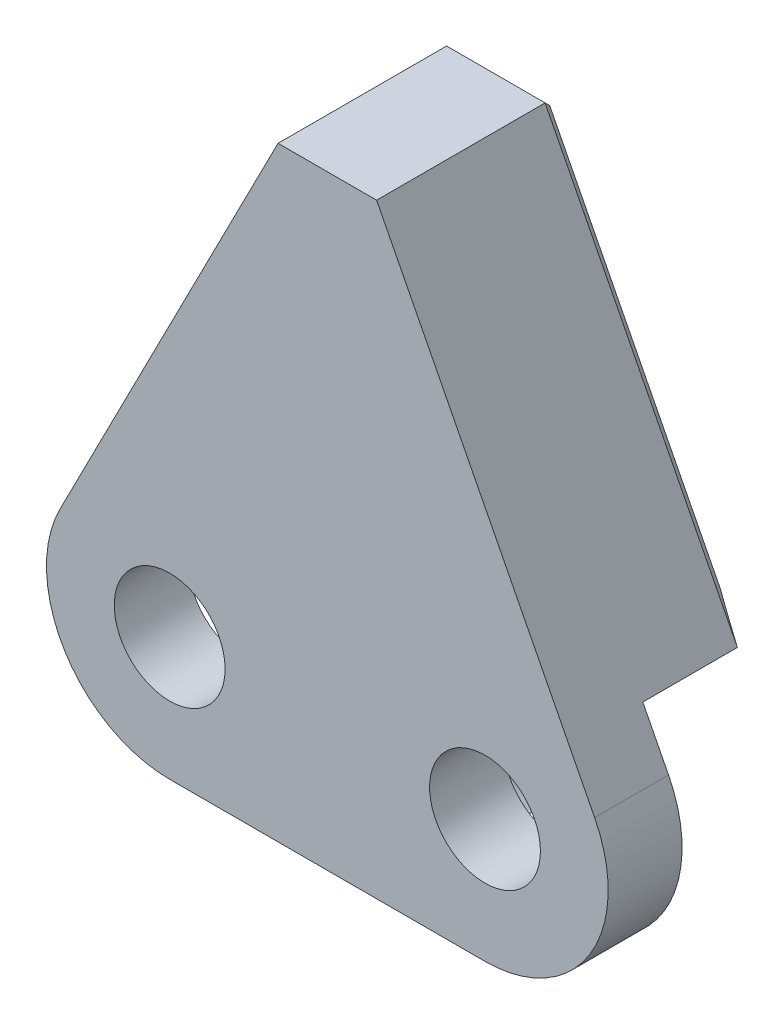
ISO-10303-21;
HEADER;
FILE_DESCRIPTION(('STEP AP214'),'2;1');
FILE_NAME('part.step','',(''),(''),'','','');
FILE_SCHEMA(('AUTOMOTIVE_DESIGN { 1 0 10303 214 1 1 1 1 }'));
ENDSEC;
DATA;
#1=APPLICATION_CONTEXT('core data for automotive mechanical design processes');
#2=APPLICATION_PROTOCOL_DEFINITION('international standard','automotive_design',2000,#1);
#3=PRODUCT_CONTEXT('',#1,'mechanical');
#4=PRODUCT('Part','Part','',(#3));
#5=PRODUCT_RELATED_PRODUCT_CATEGORY('part','',(#4));
#6=PRODUCT_DEFINITION_FORMATION('','',#4);
#7=PRODUCT_DEFINITION_CONTEXT('part definition',#1,'design');
#8=PRODUCT_DEFINITION('design','',#6,#7);
#9=PRODUCT_DEFINITION_SHAPE('','',#8);
#10=(LENGTH_UNIT() NAMED_UNIT(*) SI_UNIT(.MILLI.,.METRE.));
#11=(NAMED_UNIT(*) PLANE_ANGLE_UNIT() SI_UNIT($,.RADIAN.));
#12=(NAMED_UNIT(*) SI_UNIT($,.STERADIAN.) SOLID_ANGLE_UNIT());
#13=UNCERTAINTY_MEASURE_WITH_UNIT(LENGTH_MEASURE(1.E-05),#10,'distance_accuracy_value','');
#14=(GEOMETRIC_REPRESENTATION_CONTEXT(3) GLOBAL_UNCERTAINTY_ASSIGNED_CONTEXT((#13)) GLOBAL_UNIT_ASSIGNED_CONTEXT((#10,
#11,#12)) REPRESENTATION_CONTEXT('',''));
#15=CARTESIAN_POINT('',(0.,0.,0.));
#16=DIRECTION('',(0.,0.,1.));
#17=DIRECTION('',(1.,0.,0.));
#18=AXIS2_PLACEMENT_3D('',#15,#16,#17);
#19=CARTESIAN_POINT('',(0.,0.,1.11022302462516E-13));
#20=DIRECTION('',(0.,0.,1.00000000000004));
#21=DIRECTION('',(1.00000000000002,0.,0.));
#22=AXIS2_PLACEMENT_3D('',#19,#20,#21);
#23=PLANE('',#22);
#24=CARTESIAN_POINT('',(20.3199999999883,-1.30442627794494E-12,0.));
#25=DIRECTION('',(0.,0.,1.00000000000004));
#26=DIRECTION('',(1.00000000000002,0.,0.));
#27=AXIS2_PLACEMENT_3D('',#24,#25,#26);
#28=CIRCLE('',#27,3.57124);
#29=CARTESIAN_POINT('',(23.8912399999883,-1.3038164718836E-12,0.));
#30=VERTEX_POINT('',#29);
#31=EDGE_CURVE('E377',#30,#30,#28,.T.);
#32=ORIENTED_EDGE('',*,*,#31,.T.);
#33=EDGE_LOOP('',(#32));
#34=FACE_BOUND('',#33,.T.);
#35=CARTESIAN_POINT('',(20.3199999999883,-1.30442627794494E-12,0.));
#36=DIRECTION('',(0.,0.,1.00000000000004));
#37=DIRECTION('',(-1.00000000000002,0.,0.));
#38=AXIS2_PLACEMENT_3D('',#35,#36,#37);
#39=CIRCLE('',#38,8.73125);
#40=CARTESIAN_POINT('',(25.7266710426292,6.85584676018515,8.32667268468867E-13));
#41=VERTEX_POINT('',#40);
#42=CARTESIAN_POINT('',(14.734295665905,-6.71078487620774,-1.0547118733939E-12));
#43=VERTEX_POINT('',#42);
#44=EDGE_CURVE('E160',#41,#43,#39,.T.);
#45=ORIENTED_EDGE('',*,*,#44,.F.);
#46=DIRECTION('',(-0.455854631779661,0.890054242552123,0.));
#47=VECTOR('',#46,1.);
#48=CARTESIAN_POINT('',(13.3349999999879,31.0505321158113,-3.33066907387547E-13));
#49=LINE('',#48,#47);
#50=CARTESIAN_POINT('',(27.3848055502328,3.61834613975105,0.));
#51=VERTEX_POINT('',#50);
#52=EDGE_CURVE('E170',#51,#41,#49,.T.);
#53=ORIENTED_EDGE('',*,*,#52,.F.);
#54=CARTESIAN_POINT('',(20.3199999999746,0.,3.60822483003176E-13));
#55=DIRECTION('',(0.,0.,1.00000000000004));
#56=DIRECTION('',(-1.00000000000002,0.,0.));
#57=AXIS2_PLACEMENT_3D('',#54,#55,#56);
#58=CIRCLE('',#57,7.9375);
#59=CARTESIAN_POINT('',(20.3199999999744,-7.93749999999989,-7.7715611723761E-13));
#60=VERTEX_POINT('',#59);
#61=EDGE_CURVE('E182',#60,#51,#58,.T.);
#62=ORIENTED_EDGE('',*,*,#61,.F.);
#63=DIRECTION('',(1.00000000000002,0.,0.));
#64=VECTOR('',#63,1.);
#65=CARTESIAN_POINT('',(-2.08166817117217E-13,-7.93750000000005,-1.33226762955019E-12));
#66=LINE('',#65,#64);
#67=CARTESIAN_POINT('',(13.5075805421137,-7.93750000000003,-1.83186799063151E-12));
#68=VERTEX_POINT('',#67);
#69=EDGE_CURVE('E376',#68,#60,#66,.T.);
#70=ORIENTED_EDGE('',*,*,#69,.F.);
#71=DIRECTION('',(-0.707106781186563,-0.707106781186544,0.));
#72=VECTOR('',#71,1.);
#73=CARTESIAN_POINT('',(10.7225402710565,-10.7225402710567,-3.88578058618805E-13));
#74=LINE('',#73,#72);
#75=EDGE_CURVE('E173',#68,#43,#74,.F.);
#76=ORIENTED_EDGE('',*,*,#75,.T.);
#77=EDGE_LOOP('',(#45,#53,#62,#70,#76));
#78=FACE_BOUND('',#77,.T.);
#79=ADVANCED_FACE('F36',(#34,#78),#23,.F.);
#80=CARTESIAN_POINT('',(-1.23651089367627E-11,-1.26287869051112E-12,1.11022302462516E-13));
#81=DIRECTION('',(0.,0.,1.00000000000004));
#82=DIRECTION('',(1.00000000000002,0.,0.));
#83=AXIS2_PLACEMENT_3D('',#80,#81,#82);
#84=CIRCLE('',#83,3.57124);
#85=CARTESIAN_POINT('',(3.57123999998769,-1.26226888444977E-12,1.09287670579938E-13));
#86=VERTEX_POINT('',#85);
#87=EDGE_CURVE('E389',#86,#86,#84,.T.);
#88=ORIENTED_EDGE('',*,*,#87,.T.);
#89=EDGE_LOOP('',(#88));
#90=FACE_BOUND('',#89,.T.);
#91=CARTESIAN_POINT('',(0.,0.,0.));
#92=DIRECTION('',(0.,0.,1.00000000000004));
#93=DIRECTION('',(-1.00000000000002,0.,0.));
#94=AXIS2_PLACEMENT_3D('',#91,#92,#93);
#95=CIRCLE('',#94,8.73125);
#96=CARTESIAN_POINT('',(5.58570433407973,-6.7107848762083,-7.7715611723761E-13));
#97=VERTEX_POINT('',#96);
#98=CARTESIAN_POINT('',(-5.40667104266308,6.85584676017096,1.27675647831893E-12));
#99=VERTEX_POINT('',#98);
#100=EDGE_CURVE('E174',#97,#99,#95,.T.);
#101=ORIENTED_EDGE('',*,*,#100,.F.);
#102=DIRECTION('',(-0.707106781186563,0.707106781186543,0.));
#103=VECTOR('',#102,1.);
#104=CARTESIAN_POINT('',(-0.562540271064504,-0.562540271064428,-2.77555756156289E-13));
#105=LINE('',#104,#103);
#106=CARTESIAN_POINT('',(6.81241945787053,-7.93750000000002,-1.22124532708767E-12));
#107=VERTEX_POINT('',#106);
#108=EDGE_CURVE('E211',#97,#107,#105,.F.);
#109=ORIENTED_EDGE('',*,*,#108,.T.);
#110=CARTESIAN_POINT('',(-2.08166817117217E-13,-7.93750000000005,-1.33226762955019E-12));
#111=VERTEX_POINT('',#110);
#112=EDGE_CURVE('E186',#111,#107,#66,.T.);
#113=ORIENTED_EDGE('',*,*,#112,.F.);
#114=CARTESIAN_POINT('',(0.,0.,1.11022302462516E-13));
#115=DIRECTION('',(0.,0.,1.00000000000004));
#116=DIRECTION('',(1.00000000000002,0.,0.));
#117=AXIS2_PLACEMENT_3D('',#114,#115,#116);
#118=CIRCLE('',#117,7.9375);
#119=CARTESIAN_POINT('',(-7.06480555025765,3.61834613975104,-1.49880108324396E-12));
#120=VERTEX_POINT('',#119);
#121=EDGE_CURVE('E374',#120,#111,#118,.T.);
#122=ORIENTED_EDGE('',*,*,#121,.F.);
#123=DIRECTION('',(-0.455854631779664,-0.890054242552123,0.));
#124=VECTOR('',#123,1.);
#125=CARTESIAN_POINT('',(6.98499999998828,31.0505321158113,-6.66133814775094E-13));
#126=LINE('',#125,#124);
#127=EDGE_CURVE('E181',#99,#120,#126,.T.);
#128=ORIENTED_EDGE('',*,*,#127,.F.);
#129=EDGE_LOOP('',(#101,#109,#113,#122,#128));
#130=FACE_BOUND('',#129,.T.);
#131=ADVANCED_FACE('F308',(#90,#130),#23,.F.);
#132=CARTESIAN_POINT('',(0.,0.,4.76250000000017));
#133=DIRECTION('',(0.,0.,-1.00000000000003));
#134=DIRECTION('',(-1.00000000000002,0.,0.));
#135=AXIS2_PLACEMENT_3D('',#132,#133,#134);
#136=CYLINDRICAL_SURFACE('',#135,7.9375);
#137=ORIENTED_EDGE('',*,*,#121,.T.);
#138=DIRECTION('',(0.,0.,-1.00000000000003));
#139=VECTOR('',#138,1.);
#140=CARTESIAN_POINT('',(-4.16333634234434E-13,-7.93750000000003,4.76249999999884));
#141=LINE('',#140,#139);
#142=CARTESIAN_POINT('',(-4.16333634234434E-13,-7.93750000000003,4.76249999999884));
#143=VERTEX_POINT('',#142);
#144=EDGE_CURVE('E204',#143,#111,#141,.T.);
#145=ORIENTED_EDGE('',*,*,#144,.F.);
#146=CARTESIAN_POINT('',(0.,0.,4.76250000000017));
#147=DIRECTION('',(0.,0.,1.00000000000004));
#148=DIRECTION('',(1.00000000000002,0.,0.));
#149=AXIS2_PLACEMENT_3D('',#146,#147,#148);
#150=CIRCLE('',#149,7.9375);
#151=CARTESIAN_POINT('',(-7.0648055502581,3.618346139751,4.76249999999911));
#152=VERTEX_POINT('',#151);
#153=EDGE_CURVE('E184',#152,#143,#150,.T.);
#154=ORIENTED_EDGE('',*,*,#153,.F.);
#155=DIRECTION('',(0.,0.,-1.00000000000003));
#156=VECTOR('',#155,1.);
#157=CARTESIAN_POINT('',(-7.0648055502581,3.618346139751,4.76249999999911));
#158=LINE('',#157,#156);
#159=EDGE_CURVE('E190',#152,#120,#158,.T.);
#160=ORIENTED_EDGE('',*,*,#159,.T.);
#161=EDGE_LOOP('',(#137,#145,#154,#160));
#162=FACE_BOUND('',#161,.T.);
#163=ADVANCED_FACE('F314',(#162),#136,.T.);
#164=CARTESIAN_POINT('',(-4.16333634234434E-13,-7.93750000000003,4.76249999999884));
#165=DIRECTION('',(0.,1.,0.));
#166=DIRECTION('',(-1.00000000000002,0.,0.));
#167=AXIS2_PLACEMENT_3D('',#164,#165,#166);
#168=PLANE('',#167);
#169=DIRECTION('',(0.,0.,-1.00000000000004));
#170=VECTOR('',#169,1.);
#171=CARTESIAN_POINT('',(6.81241945787039,-7.93750000000001,4.76249999999984));
#172=LINE('',#171,#170);
#173=CARTESIAN_POINT('',(6.81241945787142,-7.93749999999999,-6.09600000000038));
#174=VERTEX_POINT('',#173);
#175=EDGE_CURVE('E209',#107,#174,#172,.T.);
#176=ORIENTED_EDGE('',*,*,#175,.T.);
#177=DIRECTION('',(1.00000000000002,0.,0.));
#178=VECTOR('',#177,1.);
#179=CARTESIAN_POINT('',(13.507580542113,-7.93749999999991,-6.09600000000077));
#180=LINE('',#179,#178);
#181=CARTESIAN_POINT('',(13.507580542113,-7.93749999999991,-6.09600000000077));
#182=VERTEX_POINT('',#181);
#183=EDGE_CURVE('E66',#174,#182,#180,.T.);
#184=ORIENTED_EDGE('',*,*,#183,.T.);
#185=DIRECTION('',(0.,0.,1.00000000000004));
#186=VECTOR('',#185,1.);
#187=CARTESIAN_POINT('',(13.5075805421135,-7.93749999999988,4.76249999999889));
#188=LINE('',#187,#186);
#189=EDGE_CURVE('E214',#182,#68,#188,.T.);
#190=ORIENTED_EDGE('',*,*,#189,.T.);
#191=ORIENTED_EDGE('',*,*,#69,.T.);
#192=DIRECTION('',(0.,0.,-1.00000000000003));
#193=VECTOR('',#192,1.);
#194=CARTESIAN_POINT('',(20.3199999999756,-7.93749999999991,4.7624999999995));
#195=LINE('',#194,#193);
#196=CARTESIAN_POINT('',(20.3199999999756,-7.93749999999991,4.7624999999995));
#197=VERTEX_POINT('',#196);
#198=EDGE_CURVE('E201',#197,#60,#195,.T.);
#199=ORIENTED_EDGE('',*,*,#198,.F.);
#200=DIRECTION('',(1.00000000000002,0.,0.));
#201=VECTOR('',#200,1.);
#202=CARTESIAN_POINT('',(-4.16333634234434E-13,-7.93750000000003,4.76249999999884));
#203=LINE('',#202,#201);
#204=EDGE_CURVE('E380',#143,#197,#203,.T.);
#205=ORIENTED_EDGE('',*,*,#204,.F.);
#206=ORIENTED_EDGE('',*,*,#144,.T.);
#207=ORIENTED_EDGE('',*,*,#112,.T.);
#208=EDGE_LOOP('',(#176,#184,#190,#191,#199,#205,#206,#207));
#209=FACE_BOUND('',#208,.T.);
#210=ADVANCED_FACE('F334',(#209),#168,.F.);
#211=CARTESIAN_POINT('',(20.3199999999755,0.,4.76249999999973));
#212=DIRECTION('',(0.,0.,-1.00000000000003));
#213=DIRECTION('',(-1.00000000000002,0.,0.));
#214=AXIS2_PLACEMENT_3D('',#211,#212,#213);
#215=CYLINDRICAL_SURFACE('',#214,7.9375);
#216=ORIENTED_EDGE('',*,*,#61,.T.);
#217=DIRECTION('',(0.,0.,-1.00000000000003));
#218=VECTOR('',#217,1.);
#219=CARTESIAN_POINT('',(27.384805550233,3.61834613975109,4.76249999999973));
#220=LINE('',#219,#218);
#221=CARTESIAN_POINT('',(27.384805550233,3.61834613975109,4.76249999999973));
#222=VERTEX_POINT('',#221);
#223=EDGE_CURVE('E180',#222,#51,#220,.T.);
#224=ORIENTED_EDGE('',*,*,#223,.F.);
#225=CARTESIAN_POINT('',(20.3199999999755,0.,4.76249999999973));
#226=DIRECTION('',(0.,0.,1.00000000000004));
#227=DIRECTION('',(-1.00000000000002,0.,0.));
#228=AXIS2_PLACEMENT_3D('',#225,#226,#227);
#229=CIRCLE('',#228,7.9375);
#230=EDGE_CURVE('E370',#197,#222,#229,.T.);
#231=ORIENTED_EDGE('',*,*,#230,.F.);
#232=ORIENTED_EDGE('',*,*,#198,.T.);
#233=EDGE_LOOP('',(#216,#224,#231,#232));
#234=FACE_BOUND('',#233,.T.);
#235=ADVANCED_FACE('F331',(#234),#215,.T.);
#236=CARTESIAN_POINT('',(13.3349999999876,31.0505321158113,4.76249999999873));
#237=DIRECTION('',(-0.89005424255214,-0.455854631779657,0.));
#238=DIRECTION('',(0.455854631779661,-0.890054242552123,0.));
#239=AXIS2_PLACEMENT_3D('',#236,#237,#238);
#240=PLANE('',#239);
#241=DIRECTION('',(0.,0.,1.00000000000004));
#242=VECTOR('',#241,1.);
#243=CARTESIAN_POINT('',(25.7266710426292,6.85584676018507,-51.570158260653));
#244=LINE('',#243,#242);
#245=CARTESIAN_POINT('',(25.7266710426295,6.85584676018515,-6.09599999999999));
#246=VERTEX_POINT('',#245);
#247=EDGE_CURVE('E157',#246,#41,#244,.T.);
#248=ORIENTED_EDGE('',*,*,#247,.F.);
#249=DIRECTION('',(-0.455854631779661,0.890054242552123,0.));
#250=VECTOR('',#249,1.);
#251=CARTESIAN_POINT('',(13.3349999999871,31.0505321158111,-6.09600000000088));
#252=LINE('',#251,#250);
#253=CARTESIAN_POINT('',(13.3349999999866,31.0505321158111,-6.09600000000132));
#254=VERTEX_POINT('',#253);
#255=EDGE_CURVE('E236',#246,#254,#252,.T.);
#256=ORIENTED_EDGE('',*,*,#255,.T.);
#257=DIRECTION('',(0.,0.,-1.00000000000003));
#258=VECTOR('',#257,1.);
#259=CARTESIAN_POINT('',(13.3349999999876,31.0505321158113,4.76249999999873));
#260=LINE('',#259,#258);
#261=CARTESIAN_POINT('',(13.3349999999876,31.0505321158113,4.76249999999873));
#262=VERTEX_POINT('',#261);
#263=EDGE_CURVE('E197',#262,#254,#260,.T.);
#264=ORIENTED_EDGE('',*,*,#263,.F.);
#265=DIRECTION('',(-0.455854631779661,0.890054242552123,0.));
#266=VECTOR('',#265,1.);
#267=CARTESIAN_POINT('',(13.3349999999876,31.0505321158113,4.76249999999873));
#268=LINE('',#267,#266);
#269=EDGE_CURVE('E367',#222,#262,#268,.T.);
#270=ORIENTED_EDGE('',*,*,#269,.F.);
#271=ORIENTED_EDGE('',*,*,#223,.T.);
#272=ORIENTED_EDGE('',*,*,#52,.T.);
#273=EDGE_LOOP('',(#248,#256,#264,#270,#271,#272));
#274=FACE_BOUND('',#273,.T.);
#275=ADVANCED_FACE('F177',(#274),#240,.F.);
#276=CARTESIAN_POINT('',(13.3349999999876,31.0505321158113,4.76249999999873));
#277=DIRECTION('',(0.,-1.,0.));
#278=DIRECTION('',(0.,0.,-1.00000000000004));
#279=AXIS2_PLACEMENT_3D('',#276,#277,#278);
#280=PLANE('',#279);
#281=ORIENTED_EDGE('',*,*,#263,.T.);
#282=DIRECTION('',(-1.00000000000002,0.,0.));
#283=VECTOR('',#282,1.);
#284=CARTESIAN_POINT('',(6.98499999998733,31.0505321158113,-6.09600000000154));
#285=LINE('',#284,#283);
#286=CARTESIAN_POINT('',(6.98499999998733,31.0505321158113,-6.09600000000154));
#287=VERTEX_POINT('',#286);
#288=EDGE_CURVE('E238',#254,#287,#285,.T.);
#289=ORIENTED_EDGE('',*,*,#288,.T.);
#290=DIRECTION('',(0.,0.,-1.00000000000003));
#291=VECTOR('',#290,1.);
#292=CARTESIAN_POINT('',(6.98499999998783,31.0505321158113,4.76249999999911));
#293=LINE('',#292,#291);
#294=CARTESIAN_POINT('',(6.98499999998783,31.0505321158113,4.76249999999911));
#295=VERTEX_POINT('',#294);
#296=EDGE_CURVE('E193',#295,#287,#293,.T.);
#297=ORIENTED_EDGE('',*,*,#296,.F.);
#298=DIRECTION('',(-1.00000000000002,0.,0.));
#299=VECTOR('',#298,1.);
#300=CARTESIAN_POINT('',(13.3349999999876,31.0505321158113,4.76249999999873));
#301=LINE('',#300,#299);
#302=EDGE_CURVE('E364',#262,#295,#301,.T.);
#303=ORIENTED_EDGE('',*,*,#302,.F.);
#304=EDGE_LOOP('',(#281,#289,#297,#303));
#305=FACE_BOUND('',#304,.T.);
#306=ADVANCED_FACE('F324',(#305),#280,.F.);
#307=CARTESIAN_POINT('',(6.98499999998783,31.0505321158113,4.76249999999911));
#308=DIRECTION('',(0.890054242552132,-0.455854631779656,0.));
#309=DIRECTION('',(0.455854631779664,0.890054242552124,0.));
#310=AXIS2_PLACEMENT_3D('',#307,#308,#309);
#311=PLANE('',#310);
#312=ORIENTED_EDGE('',*,*,#296,.T.);
#313=DIRECTION('',(-0.455854631779664,-0.890054242552124,0.));
#314=VECTOR('',#313,1.);
#315=CARTESIAN_POINT('',(-5.40667104266126,6.85584676017086,-6.09599999999832));
#316=LINE('',#315,#314);
#317=CARTESIAN_POINT('',(-5.40667104266126,6.85584676017086,-6.09599999999832));
#318=VERTEX_POINT('',#317);
#319=EDGE_CURVE('E240',#287,#318,#316,.T.);
#320=ORIENTED_EDGE('',*,*,#319,.T.);
#321=DIRECTION('',(0.,0.,1.00000000000004));
#322=VECTOR('',#321,1.);
#323=CARTESIAN_POINT('',(-5.40667104266296,6.85584676017083,-51.5701582606531));
#324=LINE('',#323,#322);
#325=EDGE_CURVE('E394',#318,#99,#324,.T.);
#326=ORIENTED_EDGE('',*,*,#325,.T.);
#327=ORIENTED_EDGE('',*,*,#127,.T.);
#328=ORIENTED_EDGE('',*,*,#159,.F.);
#329=DIRECTION('',(-0.455854631779664,-0.890054242552123,0.));
#330=VECTOR('',#329,1.);
#331=CARTESIAN_POINT('',(6.98499999998783,31.0505321158113,4.76249999999911));
#332=LINE('',#331,#330);
#333=EDGE_CURVE('E194',#295,#152,#332,.T.);
#334=ORIENTED_EDGE('',*,*,#333,.F.);
#335=EDGE_LOOP('',(#312,#320,#326,#327,#328,#334));
#336=FACE_BOUND('',#335,.T.);
#337=ADVANCED_FACE('F321',(#336),#311,.F.);
#338=CARTESIAN_POINT('',(0.,0.,4.76250000000017));
#339=DIRECTION('',(0.,0.,1.00000000000004));
#340=DIRECTION('',(1.00000000000002,0.,0.));
#341=AXIS2_PLACEMENT_3D('',#338,#339,#340);
#342=PLANE('',#341);
#343=CARTESIAN_POINT('',(-1.26010313294955E-11,-1.24183449082143E-12,4.76249999999873));
#344=DIRECTION('',(0.,0.,1.00000000000004));
#345=DIRECTION('',(1.00000000000002,0.,0.));
#346=AXIS2_PLACEMENT_3D('',#343,#344,#345);
#347=CIRCLE('',#346,3.57123999999999);
#348=CARTESIAN_POINT('',(3.57123999998745,-1.24122468476009E-12,4.76249999999872));
#349=VERTEX_POINT('',#348);
#350=EDGE_CURVE('E392',#349,#349,#347,.T.);
#351=ORIENTED_EDGE('',*,*,#350,.F.);
#352=EDGE_LOOP('',(#351));
#353=FACE_BOUND('',#352,.T.);
#354=CARTESIAN_POINT('',(20.3199999999878,-1.29725986606307E-12,4.76250000000034));
#355=DIRECTION('',(0.,0.,1.00000000000004));
#356=DIRECTION('',(1.00000000000002,0.,0.));
#357=AXIS2_PLACEMENT_3D('',#354,#355,#356);
#358=CIRCLE('',#357,3.57123999999999);
#359=CARTESIAN_POINT('',(23.8912399999878,-1.29665006000173E-12,4.76250000000033));
#360=VERTEX_POINT('',#359);
#361=EDGE_CURVE('E386',#360,#360,#358,.T.);
#362=ORIENTED_EDGE('',*,*,#361,.F.);
#363=EDGE_LOOP('',(#362));
#364=FACE_BOUND('',#363,.T.);
#365=ORIENTED_EDGE('',*,*,#153,.T.);
#366=ORIENTED_EDGE('',*,*,#204,.T.);
#367=ORIENTED_EDGE('',*,*,#230,.T.);
#368=ORIENTED_EDGE('',*,*,#269,.T.);
#369=ORIENTED_EDGE('',*,*,#302,.T.);
#370=ORIENTED_EDGE('',*,*,#333,.T.);
#371=EDGE_LOOP('',(#365,#366,#367,#368,#369,#370));
#372=FACE_BOUND('',#371,.T.);
#373=ADVANCED_FACE('F319',(#353,#364,#372),#342,.T.);
#374=CARTESIAN_POINT('',(20.3199999999878,-1.3180765477748E-12,4.76250000000006));
#375=DIRECTION('',(0.,0.,1.00000000000004));
#376=DIRECTION('',(1.00000000000002,0.,0.));
#377=AXIS2_PLACEMENT_3D('',#374,#375,#376);
#378=CYLINDRICAL_SURFACE('',#377,3.57123999999999);
#379=ORIENTED_EDGE('',*,*,#31,.F.);
#380=EDGE_LOOP('',(#379));
#381=FACE_BOUND('',#380,.T.);
#382=ORIENTED_EDGE('',*,*,#361,.T.);
#383=EDGE_LOOP('',(#382));
#384=FACE_BOUND('',#383,.T.);
#385=ADVANCED_FACE('F433',(#381,#384),#378,.F.);
#386=CARTESIAN_POINT('',(-1.26010313294955E-11,-1.24183449082143E-12,4.76249999999873));
#387=DIRECTION('',(0.,0.,1.00000000000004));
#388=DIRECTION('',(1.00000000000002,0.,0.));
#389=AXIS2_PLACEMENT_3D('',#386,#387,#388);
#390=CYLINDRICAL_SURFACE('',#389,3.57123999999999);
#391=ORIENTED_EDGE('',*,*,#87,.F.);
#392=EDGE_LOOP('',(#391));
#393=FACE_BOUND('',#392,.T.);
#394=ORIENTED_EDGE('',*,*,#350,.T.);
#395=EDGE_LOOP('',(#394));
#396=FACE_BOUND('',#395,.T.);
#397=ADVANCED_FACE('F426',(#393,#396),#390,.F.);
#398=CARTESIAN_POINT('',(0.,0.,-6.85800000000047));
#399=DIRECTION('',(0.,0.,-1.00000000000004));
#400=DIRECTION('',(-1.00000000000002,0.,0.));
#401=AXIS2_PLACEMENT_3D('',#398,#399,#400);
#402=PLANE('',#401);
#403=DIRECTION('',(1.00000000000002,0.,0.));
#404=VECTOR('',#403,1.);
#405=CARTESIAN_POINT('',(13.3349999999867,30.2885321158113,-6.85800000000003));
#406=LINE('',#405,#404);
#407=CARTESIAN_POINT('',(7.45085786657587,30.2885321158113,-6.85800000000136));
#408=VERTEX_POINT('',#407);
#409=CARTESIAN_POINT('',(12.8691421333977,30.2885321158114,-6.85800000000139));
#410=VERTEX_POINT('',#409);
#411=EDGE_CURVE('E231',#408,#410,#406,.T.);
#412=ORIENTED_EDGE('',*,*,#411,.T.);
#413=DIRECTION('',(0.455854631779662,-0.890054242552123,0.));
#414=VECTOR('',#413,1.);
#415=CARTESIAN_POINT('',(25.0484497098044,6.50848553076905,-6.85800000000186));
#416=LINE('',#415,#414);
#417=CARTESIAN_POINT('',(23.873162728778,8.80322839560663,-6.85800000000042));
#418=VERTEX_POINT('',#417);
#419=EDGE_CURVE('E233',#410,#418,#416,.T.);
#420=ORIENTED_EDGE('',*,*,#419,.T.);
#421=CARTESIAN_POINT('',(20.3199999999872,-1.30475390383321E-12,-6.85800000000072));
#422=DIRECTION('',(0.,0.,-1.00000000000004));
#423=DIRECTION('',(-1.00000000000002,0.,0.));
#424=AXIS2_PLACEMENT_3D('',#421,#422,#423);
#425=CIRCLE('',#424,9.49324999999999);
#426=CARTESIAN_POINT('',(13.6310253789904,-6.73642442859501,-6.85800000000064));
#427=VERTEX_POINT('',#426);
#428=EDGE_CURVE('E219',#418,#427,#425,.F.);
#429=ORIENTED_EDGE('',*,*,#428,.T.);
#430=DIRECTION('',(-0.707106781186563,-0.707106781186544,0.));
#431=VECTOR('',#430,1.);
#432=CARTESIAN_POINT('',(10.1837249037929,-10.1837249037926,-6.85800000000092));
#433=LINE('',#432,#431);
#434=CARTESIAN_POINT('',(13.1919498075851,-7.17550000000005,-6.85800000000203));
#435=VERTEX_POINT('',#434);
#436=EDGE_CURVE('E221',#427,#435,#433,.T.);
#437=ORIENTED_EDGE('',*,*,#436,.T.);
#438=DIRECTION('',(-1.00000000000002,0.,0.));
#439=VECTOR('',#438,1.);
#440=CARTESIAN_POINT('',(6.81241945787128,-7.17550000000004,-6.85800000000006));
#441=LINE('',#440,#439);
#442=CARTESIAN_POINT('',(7.12805019239821,-7.17550000000004,-6.85800000000139));
#443=VERTEX_POINT('',#442);
#444=EDGE_CURVE('E223',#435,#443,#441,.T.);
#445=ORIENTED_EDGE('',*,*,#444,.T.);
#446=DIRECTION('',(-0.707106781186563,0.707106781186543,0.));
#447=VECTOR('',#446,1.);
#448=CARTESIAN_POINT('',(-0.0237249038003984,-0.0237249038003085,-6.85800000000047));
#449=LINE('',#448,#447);
#450=CARTESIAN_POINT('',(6.68897462099408,-6.73642442859571,-6.85800000000145));
#451=VERTEX_POINT('',#450);
#452=EDGE_CURVE('E225',#443,#451,#449,.T.);
#453=ORIENTED_EDGE('',*,*,#452,.T.);
#454=CARTESIAN_POINT('',(0.,0.,-6.85800000000047));
#455=DIRECTION('',(0.,0.,-1.00000000000004));
#456=DIRECTION('',(-1.00000000000002,0.,0.));
#457=AXIS2_PLACEMENT_3D('',#454,#455,#456);
#458=CIRCLE('',#457,9.49324999999999);
#459=CARTESIAN_POINT('',(-3.55316272880546,8.80322839560201,-6.85799999999956));
#460=VERTEX_POINT('',#459);
#461=EDGE_CURVE('E227',#451,#460,#458,.F.);
#462=ORIENTED_EDGE('',*,*,#461,.T.);
#463=DIRECTION('',(0.455854631779664,0.890054242552124,0.));
#464=VECTOR('',#463,1.);
#465=CARTESIAN_POINT('',(7.66322133281228,30.7031708863953,-6.858));
#466=LINE('',#465,#464);
#467=EDGE_CURVE('E229',#460,#408,#466,.T.);
#468=ORIENTED_EDGE('',*,*,#467,.T.);
#469=EDGE_LOOP('',(#412,#420,#429,#437,#445,#453,#462,#468));
#470=FACE_BOUND('',#469,.T.);
#471=ADVANCED_FACE('F417',(#470),#402,.T.);
#472=CARTESIAN_POINT('',(20.3199999999881,-1.29995103509211E-12,-51.5701582606547));
#473=DIRECTION('',(0.,0.,1.00000000000004));
#474=DIRECTION('',(1.00000000000002,0.,0.));
#475=AXIS2_PLACEMENT_3D('',#472,#473,#474);
#476=CYLINDRICAL_SURFACE('',#475,8.73125);
#477=DIRECTION('',(0.,0.,1.00000000000004));
#478=VECTOR('',#477,1.);
#479=CARTESIAN_POINT('',(14.7342956659052,-6.71078487620774,-51.5701582606558));
#480=LINE('',#479,#478);
#481=CARTESIAN_POINT('',(14.7342956659064,-6.71078487620777,-6.0960000000016));
#482=VERTEX_POINT('',#481);
#483=EDGE_CURVE('E216',#43,#482,#480,.F.);
#484=ORIENTED_EDGE('',*,*,#483,.T.);
#485=CARTESIAN_POINT('',(20.3199999999876,-1.28390081924502E-12,-6.09599999999993));
#486=DIRECTION('',(0.,0.,-1.00000000000004));
#487=DIRECTION('',(-1.00000000000002,0.,0.));
#488=AXIS2_PLACEMENT_3D('',#485,#486,#487);
#489=CIRCLE('',#488,8.73125);
#490=EDGE_CURVE('E11',#482,#246,#489,.T.);
#491=ORIENTED_EDGE('',*,*,#490,.T.);
#492=ORIENTED_EDGE('',*,*,#247,.T.);
#493=ORIENTED_EDGE('',*,*,#44,.T.);
#494=EDGE_LOOP('',(#484,#491,#492,#493));
#495=FACE_BOUND('',#494,.T.);
#496=ADVANCED_FACE('F159',(#495),#476,.F.);
#497=CARTESIAN_POINT('',(-1.52655665885959E-13,0.,-51.5701582606548));
#498=DIRECTION('',(0.,0.,1.00000000000004));
#499=DIRECTION('',(1.00000000000002,0.,0.));
#500=AXIS2_PLACEMENT_3D('',#497,#498,#499);
#501=CYLINDRICAL_SURFACE('',#500,8.73125);
#502=ORIENTED_EDGE('',*,*,#325,.F.);
#503=CARTESIAN_POINT('',(-6.66133814775094E-13,0.,-6.09600000000032));
#504=DIRECTION('',(0.,0.,-1.00000000000004));
#505=DIRECTION('',(-1.00000000000002,0.,0.));
#506=AXIS2_PLACEMENT_3D('',#503,#504,#505);
#507=CIRCLE('',#506,8.73125);
#508=CARTESIAN_POINT('',(5.58570433407859,-6.71078487620832,-6.09600000000163));
#509=VERTEX_POINT('',#508);
#510=EDGE_CURVE('E242',#318,#509,#507,.T.);
#511=ORIENTED_EDGE('',*,*,#510,.T.);
#512=DIRECTION('',(0.,0.,1.00000000000004));
#513=VECTOR('',#512,1.);
#514=CARTESIAN_POINT('',(5.58570433407957,-6.71078487620834,-51.5701582606543));
#515=LINE('',#514,#513);
#516=EDGE_CURVE('E207',#509,#97,#515,.T.);
#517=ORIENTED_EDGE('',*,*,#516,.T.);
#518=ORIENTED_EDGE('',*,*,#100,.T.);
#519=EDGE_LOOP('',(#502,#511,#517,#518));
#520=FACE_BOUND('',#519,.T.);
#521=ADVANCED_FACE('F344',(#520),#501,.F.);
#522=CARTESIAN_POINT('',(5.58570433407957,-6.71078487620834,-51.5701582606543));
#523=DIRECTION('',(0.707106781186552,0.707106781186552,0.));
#524=DIRECTION('',(0.,0.,1.00000000000004));
#525=AXIS2_PLACEMENT_3D('',#522,#523,#524);
#526=PLANE('',#525);
#527=ORIENTED_EDGE('',*,*,#516,.F.);
#528=DIRECTION('',(-0.707106781186563,0.707106781186543,0.));
#529=VECTOR('',#528,1.);
#530=CARTESIAN_POINT('',(5.58570433407859,-6.71078487620832,-6.09600000000163));
#531=LINE('',#530,#529);
#532=EDGE_CURVE('E244',#509,#174,#531,.F.);
#533=ORIENTED_EDGE('',*,*,#532,.T.);
#534=ORIENTED_EDGE('',*,*,#175,.F.);
#535=ORIENTED_EDGE('',*,*,#108,.F.);
#536=EDGE_LOOP('',(#527,#533,#534,#535));
#537=FACE_BOUND('',#536,.T.);
#538=ADVANCED_FACE('F341',(#537),#526,.F.);
#539=CARTESIAN_POINT('',(13.5075805421138,-7.93750000000005,-51.5701582606549));
#540=DIRECTION('',(-0.70710678118655,0.70710678118655,0.));
#541=DIRECTION('',(0.,0.,1.00000000000004));
#542=AXIS2_PLACEMENT_3D('',#539,#540,#541);
#543=PLANE('',#542);
#544=ORIENTED_EDGE('',*,*,#189,.F.);
#545=DIRECTION('',(-0.707106781186563,-0.707106781186544,0.));
#546=VECTOR('',#545,1.);
#547=CARTESIAN_POINT('',(13.507580542113,-7.93749999999991,-6.09600000000077));
#548=LINE('',#547,#546);
#549=EDGE_CURVE('E51',#182,#482,#548,.F.);
#550=ORIENTED_EDGE('',*,*,#549,.T.);
#551=ORIENTED_EDGE('',*,*,#483,.F.);
#552=ORIENTED_EDGE('',*,*,#75,.F.);
#553=EDGE_LOOP('',(#544,#550,#551,#552));
#554=FACE_BOUND('',#553,.T.);
#555=ADVANCED_FACE('F343',(#554),#543,.F.);
#556=CARTESIAN_POINT('',(-0.0237249038003984,-0.0237249038003085,-6.85800000000047));
#557=DIRECTION('',(-0.500000000000007,-0.500000000000005,-0.707106781186565));
#558=DIRECTION('',(0.707106781186563,-0.707106781186543,0.));
#559=AXIS2_PLACEMENT_3D('',#556,#557,#558);
#560=PLANE('',#559);
#561=DIRECTION('',(0.281084637714822,0.678598344545845,-0.67859834454587));
#562=VECTOR('',#561,1.);
#563=CARTESIAN_POINT('',(6.56487311443929,-8.53512973962964,-5.49837026037187));
#564=LINE('',#563,#562);
#565=EDGE_CURVE('E293',#174,#443,#564,.T.);
#566=ORIENTED_EDGE('',*,*,#565,.F.);
#567=ORIENTED_EDGE('',*,*,#532,.F.);
#568=CARTESIAN_POINT('',(5.58570433407859,-6.71078487620832,-6.09600000000163));
#569=CARTESIAN_POINT('',(5.67828783960859,-6.71501109117572,-6.15847803932462));
#570=CARTESIAN_POINT('',(5.77070959640028,-6.71868532673035,-6.22123201340443));
#571=CARTESIAN_POINT('',(5.95522245034513,-6.72497435459083,-6.34725528939742));
#572=CARTESIAN_POINT('',(6.04731358279602,-6.72758926353927,-6.4105245337911));
#573=CARTESIAN_POINT('',(6.23117735656901,-6.73180504058226,-6.53755485050546));
#574=CARTESIAN_POINT('',(6.3229500015591,-6.73340592039409,-6.60131591713444));
#575=CARTESIAN_POINT('',(6.50619167223023,-6.7356347875,-6.72931129801726));
#576=CARTESIAN_POINT('',(6.59766066335589,-6.73626266761589,-6.79354566362319));
#577=CARTESIAN_POINT('',(6.68897462099408,-6.73642442859571,-6.85800000000145));
#578=B_SPLINE_CURVE_WITH_KNOTS('',3,(#568,#569,#570,#571,#572,#573,#574,#575,#576,#577),
.UNSPECIFIED.,.F.,.F.,(4,2,2,2,4),(0.,0.33531453248571,0.670592133399142,1.00586586005243,
1.34117651526371),.UNSPECIFIED.);
#579=EDGE_CURVE('E41',#451,#509,#578,.F.);
#580=ORIENTED_EDGE('',*,*,#579,.F.);
#581=ORIENTED_EDGE('',*,*,#452,.F.);
#582=EDGE_LOOP('',(#566,#567,#580,#581));
#583=FACE_BOUND('',#582,.T.);
#584=ADVANCED_FACE('F38',(#583),#560,.T.);
#585=CARTESIAN_POINT('',(0.,0.,-6.85800000000047));
#586=DIRECTION('',(0.,0.,-1.00000000000004));
#587=DIRECTION('',(-1.00000000000002,0.,0.));
#588=AXIS2_PLACEMENT_3D('',#585,#586,#587);
#589=CONICAL_SURFACE('',#588,9.49324999999999,0.785398163397445);
#590=ORIENTED_EDGE('',*,*,#579,.T.);
#591=ORIENTED_EDGE('',*,*,#510,.F.);
#592=CARTESIAN_POINT('',(-5.40667104266126,6.85584676017086,-6.09599999999832));
#593=CARTESIAN_POINT('',(-5.26163085758216,7.03224436926732,-6.14468196492966));
#594=CARTESIAN_POINT('',(-5.11377562142348,7.20515311809624,-6.19745989112838));
#595=CARTESIAN_POINT('',(-4.81338535815055,7.54361856787348,-6.31053247639819));
#596=CARTESIAN_POINT('',(-4.66086112236973,7.70919033401651,-6.37081066305839));
#597=CARTESIAN_POINT('',(-4.3514895119982,8.03332934550884,-6.49840790766538));
#598=CARTESIAN_POINT('',(-4.19464320732431,8.1918982995343,-6.56572523442021));
#599=CARTESIAN_POINT('',(-3.87680180166929,8.50252453089237,-6.70702091966512));
#600=CARTESIAN_POINT('',(-3.71579846082726,8.65456698194356,-6.78101337070739));
#601=CARTESIAN_POINT('',(-3.55316272880546,8.80322839560201,-6.85799999999956));
#602=B_SPLINE_CURVE_WITH_KNOTS('',3,(#592,#593,#594,#595,#596,#597,#598,#599,#600,#601),
.UNSPECIFIED.,.F.,.F.,(4,2,2,2,4),(0.,0.700376782241484,1.39924165250773,2.09793504781271,
2.79813968285241),.UNSPECIFIED.);
#603=EDGE_CURVE('E286',#460,#318,#602,.F.);
#604=ORIENTED_EDGE('',*,*,#603,.F.);
#605=ORIENTED_EDGE('',*,*,#461,.F.);
#606=EDGE_LOOP('',(#590,#591,#604,#605));
#607=FACE_BOUND('',#606,.T.);
#608=ADVANCED_FACE('F294',(#607),#589,.F.);
#609=CARTESIAN_POINT('',(0.,-7.17550000000006,-6.85800000000025));
#610=DIRECTION('',(0.,-0.70710678118655,-0.707106781186568));
#611=DIRECTION('',(1.00000000000002,0.,0.));
#612=AXIS2_PLACEMENT_3D('',#609,#610,#611);
#613=PLANE('',#612);
#614=ORIENTED_EDGE('',*,*,#565,.T.);
#615=ORIENTED_EDGE('',*,*,#444,.F.);
#616=DIRECTION('',(-0.281084637714825,0.678598344545845,-0.678598344545871));
#617=VECTOR('',#616,1.);
#618=CARTESIAN_POINT('',(13.5280738059937,-7.98697511559661,-6.0465248844036));
#619=LINE('',#618,#617);
#620=EDGE_CURVE('E283',#182,#435,#619,.T.);
#621=ORIENTED_EDGE('',*,*,#620,.F.);
#622=ORIENTED_EDGE('',*,*,#183,.F.);
#623=EDGE_LOOP('',(#614,#615,#621,#622));
#624=FACE_BOUND('',#623,.T.);
#625=ADVANCED_FACE('F298',(#624),#613,.T.);
#626=CARTESIAN_POINT('',(-6.38658421743413,3.27098491033492,-6.85800000000089));
#627=DIRECTION('',(-0.629363390532473,0.322337901366693,-0.707106781186567));
#628=DIRECTION('',(-0.455854631779664,-0.890054242552124,0.));
#629=AXIS2_PLACEMENT_3D('',#626,#627,#628);
#630=PLANE('',#629);
#631=ORIENTED_EDGE('',*,*,#603,.T.);
#632=ORIENTED_EDGE('',*,*,#319,.F.);
#633=DIRECTION('',(0.396807375155903,-0.649054661419931,-0.649054661419954));
#634=VECTOR('',#633,1.);
#635=CARTESIAN_POINT('',(12.2304288426421,22.4706259582358,-14.6759061575756));
#636=LINE('',#635,#634);
#637=EDGE_CURVE('E280',#408,#287,#636,.F.);
#638=ORIENTED_EDGE('',*,*,#637,.F.);
#639=ORIENTED_EDGE('',*,*,#467,.F.);
#640=EDGE_LOOP('',(#631,#632,#638,#639));
#641=FACE_BOUND('',#640,.T.);
#642=ADVANCED_FACE('F271',(#641),#630,.T.);
#643=CARTESIAN_POINT('',(10.1837249037929,-10.1837249037926,-6.85800000000092));
#644=DIRECTION('',(0.500000000000001,-0.500000000000004,-0.707106781186565));
#645=DIRECTION('',(0.707106781186563,0.707106781186544,0.));
#646=AXIS2_PLACEMENT_3D('',#643,#644,#645);
#647=PLANE('',#646);
#648=ORIENTED_EDGE('',*,*,#620,.T.);
#649=ORIENTED_EDGE('',*,*,#436,.F.);
#650=CARTESIAN_POINT('',(14.7342956659064,-6.71078487620777,-6.0960000000016));
#651=CARTESIAN_POINT('',(14.6417121603766,-6.7150110911753,-6.15847803932486));
#652=CARTESIAN_POINT('',(14.5492904035849,-6.71868532672998,-6.22123201340475));
#653=CARTESIAN_POINT('',(14.3647775496401,-6.72497435459046,-6.34725528939779));
#654=CARTESIAN_POINT('',(14.2726864171892,-6.72758926353887,-6.41052453379143));
#655=CARTESIAN_POINT('',(14.0888226434163,-6.73180504058183,-6.53755485050584));
#656=CARTESIAN_POINT('',(13.9970499984263,-6.73340592039367,-6.60131591713491));
#657=CARTESIAN_POINT('',(13.813808327755,-6.73563478749951,-6.72931129801752));
#658=CARTESIAN_POINT('',(13.7223393366292,-6.73626266761534,-6.79354566362314));
#659=CARTESIAN_POINT('',(13.6310253789904,-6.73642442859501,-6.85800000000064));
#660=B_SPLINE_CURVE_WITH_KNOTS('',3,(#650,#651,#652,#653,#654,#655,#656,#657,#658,#659),
.UNSPECIFIED.,.F.,.F.,(4,2,2,2,4),(0.,0.335314532485689,0.670592133399101,1.00586586005237,
1.34117651526362),.UNSPECIFIED.);
#661=EDGE_CURVE('E273',#482,#427,#660,.T.);
#662=ORIENTED_EDGE('',*,*,#661,.F.);
#663=ORIENTED_EDGE('',*,*,#549,.F.);
#664=EDGE_LOOP('',(#648,#649,#662,#663));
#665=FACE_BOUND('',#664,.T.);
#666=ADVANCED_FACE('F266',(#665),#647,.T.);
#667=CARTESIAN_POINT('',(1.11022302462516E-13,30.2885321158111,-6.85800000000103));
#668=DIRECTION('',(0.,0.707106781186549,-0.707106781186571));
#669=DIRECTION('',(-1.00000000000002,0.,0.));
#670=AXIS2_PLACEMENT_3D('',#667,#668,#669);
#671=PLANE('',#670);
#672=ORIENTED_EDGE('',*,*,#637,.T.);
#673=ORIENTED_EDGE('',*,*,#288,.F.);
#674=DIRECTION('',(-0.396807375155902,-0.649054661419931,-0.649054661419954));
#675=VECTOR('',#674,1.);
#676=CARTESIAN_POINT('',(10.8428172930931,26.9740887221264,-10.1724433936854));
#677=LINE('',#676,#675);
#678=EDGE_CURVE('E256',#410,#254,#677,.F.);
#679=ORIENTED_EDGE('',*,*,#678,.F.);
#680=ORIENTED_EDGE('',*,*,#411,.F.);
#681=EDGE_LOOP('',(#672,#673,#679,#680));
#682=FACE_BOUND('',#681,.T.);
#683=ADVANCED_FACE('F270',(#682),#671,.T.);
#684=CARTESIAN_POINT('',(20.3199999999872,-1.30475390383321E-12,-6.85800000000072));
#685=DIRECTION('',(0.,0.,-1.00000000000004));
#686=DIRECTION('',(-1.00000000000002,0.,0.));
#687=AXIS2_PLACEMENT_3D('',#684,#685,#686);
#688=CONICAL_SURFACE('',#687,9.49324999999999,0.785398163397445);
#689=ORIENTED_EDGE('',*,*,#661,.T.);
#690=ORIENTED_EDGE('',*,*,#428,.F.);
#691=CARTESIAN_POINT('',(23.873162728778,8.80322839560663,-6.85800000000042));
#692=CARTESIAN_POINT('',(24.0357984607987,8.65456698194868,-6.7810133707075));
#693=CARTESIAN_POINT('',(24.1968018016401,8.50252453089814,-6.70702091966502));
#694=CARTESIAN_POINT('',(24.5146432072941,8.19189829954153,-6.56572523442004));
#695=CARTESIAN_POINT('',(24.6714895119676,8.03332934551686,-6.49840790766534));
#696=CARTESIAN_POINT('',(24.9808611223383,7.70919033402611,-6.37081066305829));
#697=CARTESIAN_POINT('',(25.1333853581187,7.54361856788385,-6.31053247639789));
#698=CARTESIAN_POINT('',(25.4337756213911,7.20515311810837,-6.19745989112832));
#699=CARTESIAN_POINT('',(25.5816308575498,7.03224436928042,-6.14468196493005));
#700=CARTESIAN_POINT('',(25.7266710426295,6.85584676018515,-6.09599999999999));
#701=B_SPLINE_CURVE_WITH_KNOTS('',3,(#691,#692,#693,#694,#695,#696,#697,#698,#699,#700),
.UNSPECIFIED.,.F.,.F.,(4,2,2,2,4),(0.,0.700204635037256,1.39889803033979,2.09776290060359,
2.79813968284263),.UNSPECIFIED.);
#702=EDGE_CURVE('E248',#246,#418,#701,.F.);
#703=ORIENTED_EDGE('',*,*,#702,.F.);
#704=ORIENTED_EDGE('',*,*,#490,.F.);
#705=EDGE_LOOP('',(#689,#690,#703,#704));
#706=FACE_BOUND('',#705,.T.);
#707=ADVANCED_FACE('F258',(#706),#688,.F.);
#708=CARTESIAN_POINT('',(22.4840182086135,11.5155272020562,-6.85800000000014));
#709=DIRECTION('',(0.629363390532477,0.322337901366689,-0.707106781186569));
#710=DIRECTION('',(-0.455854631779661,0.890054242552123,0.));
#711=AXIS2_PLACEMENT_3D('',#708,#709,#710);
#712=PLANE('',#711);
#713=ORIENTED_EDGE('',*,*,#678,.T.);
#714=ORIENTED_EDGE('',*,*,#255,.F.);
#715=ORIENTED_EDGE('',*,*,#702,.T.);
#716=ORIENTED_EDGE('',*,*,#419,.F.);
#717=EDGE_LOOP('',(#713,#714,#715,#716));
#718=FACE_BOUND('',#717,.T.);
#719=ADVANCED_FACE('F261',(#718),#712,.T.);
#720=CLOSED_SHELL('',(#79,#131,#163,#210,#235,#275,#306,#337,#373,#385,#397,#471,#496,#521,#538,
#555,#584,#608,#625,#642,#666,#683,#707,#719));
#721=MANIFOLD_SOLID_BREP('B2',#720);
#722=ADVANCED_BREP_SHAPE_REPRESENTATION('',(#18,#721),#14);
#723=SHAPE_DEFINITION_REPRESENTATION(#9,#722);
ENDSEC;
END-ISO-10303-21;
